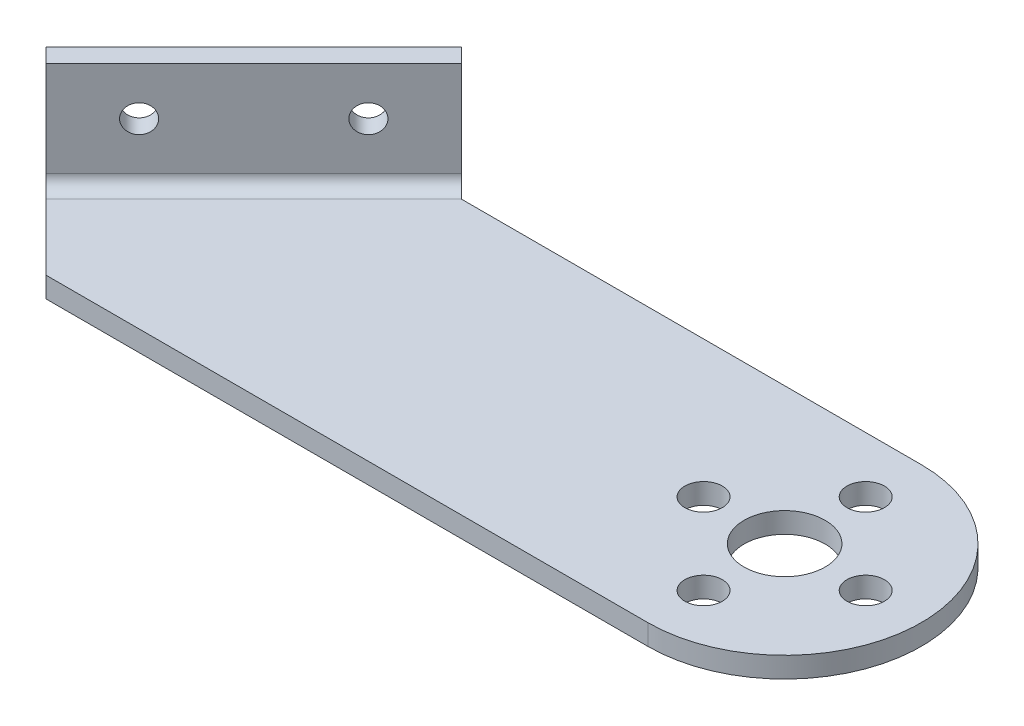
ISO-10303-21;
HEADER;
FILE_DESCRIPTION(('STEP AP214'),'2;1');
FILE_NAME('part.step','',(''),(''),'','','');
FILE_SCHEMA(('AUTOMOTIVE_DESIGN { 1 0 10303 214 1 1 1 1 }'));
ENDSEC;
DATA;
#1=APPLICATION_CONTEXT('core data for automotive mechanical design processes');
#2=APPLICATION_PROTOCOL_DEFINITION('international standard','automotive_design',2000,#1);
#3=PRODUCT_CONTEXT('',#1,'mechanical');
#4=PRODUCT('Part','Part','',(#3));
#5=PRODUCT_RELATED_PRODUCT_CATEGORY('part','',(#4));
#6=PRODUCT_DEFINITION_FORMATION('','',#4);
#7=PRODUCT_DEFINITION_CONTEXT('part definition',#1,'design');
#8=PRODUCT_DEFINITION('design','',#6,#7);
#9=PRODUCT_DEFINITION_SHAPE('','',#8);
#10=(LENGTH_UNIT() NAMED_UNIT(*) SI_UNIT(.MILLI.,.METRE.));
#11=(NAMED_UNIT(*) PLANE_ANGLE_UNIT() SI_UNIT($,.RADIAN.));
#12=(NAMED_UNIT(*) SI_UNIT($,.STERADIAN.) SOLID_ANGLE_UNIT());
#13=UNCERTAINTY_MEASURE_WITH_UNIT(LENGTH_MEASURE(1.E-05),#10,'distance_accuracy_value','');
#14=(GEOMETRIC_REPRESENTATION_CONTEXT(3) GLOBAL_UNCERTAINTY_ASSIGNED_CONTEXT((#13)) GLOBAL_UNIT_ASSIGNED_CONTEXT((#10,
#11,#12)) REPRESENTATION_CONTEXT('',''));
#15=CARTESIAN_POINT('',(0.,0.,0.));
#16=DIRECTION('',(0.,0.,1.));
#17=DIRECTION('',(1.,0.,0.));
#18=AXIS2_PLACEMENT_3D('',#15,#16,#17);
#19=CARTESIAN_POINT('',(13.7940246351911,7.968,-9.12741699796952));
#20=DIRECTION('',(-0.707106781186547,0.,-0.707106781186548));
#21=DIRECTION('',(-0.707106781186547,0.,0.707106781186548));
#22=AXIS2_PLACEMENT_3D('',#19,#20,#21);
#23=CYLINDRICAL_SURFACE('',#22,1.36525);
#24=CARTESIAN_POINT('',(11.6727042916315,7.968,-11.2487373415292));
#25=DIRECTION('',(-0.707106781186547,0.,-0.707106781186548));
#26=DIRECTION('',(-0.707106781186547,0.,0.707106781186548));
#27=AXIS2_PLACEMENT_3D('',#24,#25,#26);
#28=CIRCLE('',#27,1.36525);
#29=CARTESIAN_POINT('',(10.7073267586166,7.968,-10.2833598085142));
#30=VERTEX_POINT('',#29);
#31=EDGE_CURVE('E165',#30,#30,#28,.T.);
#32=ORIENTED_EDGE('',*,*,#31,.T.);
#33=EDGE_LOOP('',(#32));
#34=FACE_BOUND('',#33,.T.);
#35=CARTESIAN_POINT('',(13.1095452710026,7.968,-9.8118963621581));
#36=DIRECTION('',(-0.707106781186547,0.,-0.707106781186548));
#37=DIRECTION('',(-0.707106781186547,0.,0.707106781186548));
#38=AXIS2_PLACEMENT_3D('',#35,#36,#37);
#39=CIRCLE('',#38,1.36525);
#40=CARTESIAN_POINT('',(12.1441677379876,7.968,-8.84651882914316));
#41=VERTEX_POINT('',#40);
#42=EDGE_CURVE('E207',#41,#41,#39,.T.);
#43=ORIENTED_EDGE('',*,*,#42,.F.);
#44=EDGE_LOOP('',(#43));
#45=FACE_BOUND('',#44,.T.);
#46=ADVANCED_FACE('F50',(#34,#45),#23,.F.);
#47=CARTESIAN_POINT('',(2.48031613620639,7.968,2.18629150101524));
#48=DIRECTION('',(-0.707106781186547,0.,-0.707106781186548));
#49=DIRECTION('',(-0.707106781186547,0.,0.707106781186548));
#50=AXIS2_PLACEMENT_3D('',#47,#48,#49);
#51=CYLINDRICAL_SURFACE('',#50,1.36525);
#52=CARTESIAN_POINT('',(0.358995792646742,7.968,0.0649711574555985));
#53=DIRECTION('',(-0.707106781186547,0.,-0.707106781186548));
#54=DIRECTION('',(-0.707106781186547,0.,0.707106781186548));
#55=AXIS2_PLACEMENT_3D('',#52,#53,#54);
#56=CIRCLE('',#55,1.36525);
#57=CARTESIAN_POINT('',(-0.606381740368192,7.968,1.03034869047053));
#58=VERTEX_POINT('',#57);
#59=EDGE_CURVE('E226',#58,#58,#56,.T.);
#60=ORIENTED_EDGE('',*,*,#59,.T.);
#61=EDGE_LOOP('',(#60));
#62=FACE_BOUND('',#61,.T.);
#63=CARTESIAN_POINT('',(1.79583677201781,7.968,1.50181213682667));
#64=DIRECTION('',(-0.707106781186547,0.,-0.707106781186548));
#65=DIRECTION('',(-0.707106781186547,0.,0.707106781186548));
#66=AXIS2_PLACEMENT_3D('',#63,#64,#65);
#67=CIRCLE('',#66,1.36525);
#68=CARTESIAN_POINT('',(0.830459239002876,7.968,2.4671896698416));
#69=VERTEX_POINT('',#68);
#70=EDGE_CURVE('E212',#69,#69,#67,.T.);
#71=ORIENTED_EDGE('',*,*,#70,.F.);
#72=EDGE_LOOP('',(#71));
#73=FACE_BOUND('',#72,.T.);
#74=ADVANCED_FACE('F245',(#62,#73),#51,.F.);
#75=CARTESIAN_POINT('',(70.5718707373461,12.668,38.4580409487604));
#76=DIRECTION('',(0.,1.,0.));
#77=DIRECTION('',(-0.707106781186548,0.,0.707106781186548));
#78=AXIS2_PLACEMENT_3D('',#75,#76,#77);
#79=PLANE('',#78);
#80=DIRECTION('',(-0.707106781186547,0.,-0.707106781186548));
#81=VECTOR('',#80,1.);
#82=CARTESIAN_POINT('',(70.5718707373461,12.668,38.4580409487604));
#83=LINE('',#82,#81);
#84=CARTESIAN_POINT('',(17.7057393487151,12.668,-14.4080904398707));
#85=VERTEX_POINT('',#84);
#86=CARTESIAN_POINT('',(16.2688983693441,12.668,-15.8449314192417));
#87=VERTEX_POINT('',#86);
#88=EDGE_CURVE('E224',#85,#87,#83,.T.);
#89=ORIENTED_EDGE('',*,*,#88,.T.);
#90=DIRECTION('',(-0.707106781186547,0.,0.707106781186548));
#91=VECTOR('',#90,1.);
#92=CARTESIAN_POINT('',(16.2688983693441,12.668,-15.8449314192417));
#93=LINE('',#92,#91);
#94=CARTESIAN_POINT('',(-4.23719828506581,12.668,4.66116523516816));
#95=VERTEX_POINT('',#94);
#96=EDGE_CURVE('E146',#87,#95,#93,.T.);
#97=ORIENTED_EDGE('',*,*,#96,.T.);
#98=DIRECTION('',(-0.707106781186547,0.,-0.707106781186548));
#99=VECTOR('',#98,1.);
#100=CARTESIAN_POINT('',(50.0657740829363,12.668,58.9641376031703));
#101=LINE('',#100,#99);
#102=CARTESIAN_POINT('',(-2.80035730569475,12.668,6.09800621453922));
#103=VERTEX_POINT('',#102);
#104=EDGE_CURVE('E215',#103,#95,#101,.T.);
#105=ORIENTED_EDGE('',*,*,#104,.F.);
#106=DIRECTION('',(0.707106781186547,0.,-0.707106781186548));
#107=VECTOR('',#106,1.);
#108=CARTESIAN_POINT('',(17.7057393487151,12.668,-14.4080904398707));
#109=LINE('',#108,#107);
#110=EDGE_CURVE('E69',#103,#85,#109,.T.);
#111=ORIENTED_EDGE('',*,*,#110,.T.);
#112=EDGE_LOOP('',(#89,#97,#105,#111));
#113=FACE_BOUND('',#112,.T.);
#114=ADVANCED_FACE('F242',(#113),#79,.T.);
#115=CARTESIAN_POINT('',(70.5718707373461,12.668,38.4580409487604));
#116=DIRECTION('',(0.707106781186548,0.,-0.707106781186547));
#117=DIRECTION('',(0.,1.,0.));
#118=AXIS2_PLACEMENT_3D('',#115,#116,#117);
#119=PLANE('',#118);
#120=DIRECTION('',(-0.707106781186547,0.,-0.707106781186548));
#121=VECTOR('',#120,1.);
#122=CARTESIAN_POINT('',(70.5718707373461,3.27,38.4580409487604));
#123=LINE('',#122,#121);
#124=CARTESIAN_POINT('',(17.7057393487151,3.27,-14.4080904398707));
#125=VERTEX_POINT('',#124);
#126=CARTESIAN_POINT('',(16.2688983693441,3.27000000000001,-15.8449314192417));
#127=VERTEX_POINT('',#126);
#128=EDGE_CURVE('E148',#125,#127,#123,.T.);
#129=ORIENTED_EDGE('',*,*,#128,.T.);
#130=DIRECTION('',(0.,1.,0.));
#131=VECTOR('',#130,1.);
#132=CARTESIAN_POINT('',(16.2688983693441,-0.0320000000000003,-15.8449314192417));
#133=LINE('',#132,#131);
#134=EDGE_CURVE('E94',#127,#87,#133,.T.);
#135=ORIENTED_EDGE('',*,*,#134,.T.);
#136=ORIENTED_EDGE('',*,*,#88,.F.);
#137=DIRECTION('',(0.,-1.,0.));
#138=VECTOR('',#137,1.);
#139=CARTESIAN_POINT('',(17.7057393487151,12.668,-14.4080904398707));
#140=LINE('',#139,#138);
#141=EDGE_CURVE('E147',#85,#125,#140,.T.);
#142=ORIENTED_EDGE('',*,*,#141,.T.);
#143=EDGE_LOOP('',(#129,#135,#136,#142));
#144=FACE_BOUND('',#143,.T.);
#145=ADVANCED_FACE('F152',(#144),#119,.T.);
#146=CARTESIAN_POINT('',(16.2688983693441,-0.0320000000000003,-15.8449314192417));
#147=DIRECTION('',(-0.707106781186547,0.,-0.707106781186548));
#148=DIRECTION('',(-0.707106781186548,0.,0.707106781186548));
#149=AXIS2_PLACEMENT_3D('',#146,#147,#148);
#150=PLANE('',#149);
#151=DIRECTION('',(0.707106781186548,0.,-0.707106781186547));
#152=VECTOR('',#151,1.);
#153=CARTESIAN_POINT('',(16.2688983693441,3.27,-15.8449314192417));
#154=LINE('',#153,#152);
#155=CARTESIAN_POINT('',(-4.23719828506581,3.27,4.66116523516816));
#156=VERTEX_POINT('',#155);
#157=EDGE_CURVE('E88',#156,#127,#154,.T.);
#158=ORIENTED_EDGE('',*,*,#157,.F.);
#159=DIRECTION('',(0.,1.,0.));
#160=VECTOR('',#159,1.);
#161=CARTESIAN_POINT('',(-4.23719828506582,12.668,4.66116523516816));
#162=LINE('',#161,#160);
#163=EDGE_CURVE('E217',#156,#95,#162,.T.);
#164=ORIENTED_EDGE('',*,*,#163,.T.);
#165=ORIENTED_EDGE('',*,*,#96,.F.);
#166=ORIENTED_EDGE('',*,*,#134,.F.);
#167=EDGE_LOOP('',(#158,#164,#165,#166));
#168=FACE_BOUND('',#167,.T.);
#169=ORIENTED_EDGE('',*,*,#59,.F.);
#170=EDGE_LOOP('',(#169));
#171=FACE_BOUND('',#170,.T.);
#172=ORIENTED_EDGE('',*,*,#31,.F.);
#173=EDGE_LOOP('',(#172));
#174=FACE_BOUND('',#173,.T.);
#175=ADVANCED_FACE('F143',(#168,#171,#174),#150,.T.);
#176=CARTESIAN_POINT('',(50.0657740829363,12.668,58.9641376031703));
#177=DIRECTION('',(0.707106781186548,0.,-0.707106781186547));
#178=DIRECTION('',(0.,1.,0.));
#179=AXIS2_PLACEMENT_3D('',#176,#177,#178);
#180=PLANE('',#179);
#181=ORIENTED_EDGE('',*,*,#163,.F.);
#182=DIRECTION('',(-0.707106781186547,0.,-0.707106781186548));
#183=VECTOR('',#182,1.);
#184=CARTESIAN_POINT('',(50.0657740829363,3.27,58.9641376031703));
#185=LINE('',#184,#183);
#186=CARTESIAN_POINT('',(-2.80035730569475,3.27,6.09800621453922));
#187=VERTEX_POINT('',#186);
#188=EDGE_CURVE('E54',#187,#156,#185,.T.);
#189=ORIENTED_EDGE('',*,*,#188,.F.);
#190=DIRECTION('',(0.,-1.,0.));
#191=VECTOR('',#190,1.);
#192=CARTESIAN_POINT('',(-2.80035730569475,12.668,6.09800621453922));
#193=LINE('',#192,#191);
#194=EDGE_CURVE('E60',#103,#187,#193,.T.);
#195=ORIENTED_EDGE('',*,*,#194,.F.);
#196=ORIENTED_EDGE('',*,*,#104,.T.);
#197=EDGE_LOOP('',(#181,#189,#195,#196));
#198=FACE_BOUND('',#197,.T.);
#199=ADVANCED_FACE('F235',(#198),#180,.F.);
#200=CARTESIAN_POINT('',(17.7057393487151,12.668,-14.4080904398707));
#201=DIRECTION('',(-0.707106781186547,0.,-0.707106781186548));
#202=DIRECTION('',(-0.707106781186547,0.,0.707106781186548));
#203=AXIS2_PLACEMENT_3D('',#200,#201,#202);
#204=PLANE('',#203);
#205=ORIENTED_EDGE('',*,*,#70,.T.);
#206=EDGE_LOOP('',(#205));
#207=FACE_BOUND('',#206,.T.);
#208=ORIENTED_EDGE('',*,*,#42,.T.);
#209=EDGE_LOOP('',(#208));
#210=FACE_BOUND('',#209,.T.);
#211=ORIENTED_EDGE('',*,*,#194,.T.);
#212=DIRECTION('',(0.707106781186548,0.,-0.707106781186547));
#213=VECTOR('',#212,1.);
#214=CARTESIAN_POINT('',(17.7057393487151,3.27,-14.4080904398706));
#215=LINE('',#214,#213);
#216=EDGE_CURVE('E13',#187,#125,#215,.T.);
#217=ORIENTED_EDGE('',*,*,#216,.T.);
#218=ORIENTED_EDGE('',*,*,#141,.F.);
#219=ORIENTED_EDGE('',*,*,#110,.F.);
#220=EDGE_LOOP('',(#211,#217,#218,#219));
#221=FACE_BOUND('',#220,.T.);
#222=ADVANCED_FACE('F52',(#207,#210,#221),#204,.F.);
#223=CARTESIAN_POINT('',(64.,-0.0319999999999999,0.));
#224=DIRECTION('',(0.,1.,0.));
#225=DIRECTION('',(0.,0.,1.));
#226=AXIS2_PLACEMENT_3D('',#223,#224,#225);
#227=PLANE('',#226);
#228=CARTESIAN_POINT('',(56.,-0.0319999999999999,0.));
#229=DIRECTION('',(0.,1.,0.));
#230=DIRECTION('',(0.,0.,-1.));
#231=AXIS2_PLACEMENT_3D('',#228,#229,#230);
#232=CIRCLE('',#231,1.85);
#233=CARTESIAN_POINT('',(56.,-0.0319999999999999,-1.85));
#234=VERTEX_POINT('',#233);
#235=EDGE_CURVE('E290',#234,#234,#232,.T.);
#236=ORIENTED_EDGE('',*,*,#235,.T.);
#237=EDGE_LOOP('',(#236));
#238=FACE_BOUND('',#237,.T.);
#239=CARTESIAN_POINT('',(64.,-0.0319999999999999,8.));
#240=DIRECTION('',(0.,1.,0.));
#241=DIRECTION('',(0.,0.,-1.));
#242=AXIS2_PLACEMENT_3D('',#239,#240,#241);
#243=CIRCLE('',#242,1.85);
#244=CARTESIAN_POINT('',(64.,-0.0319999999999999,6.15));
#245=VERTEX_POINT('',#244);
#246=EDGE_CURVE('E371',#245,#245,#243,.T.);
#247=ORIENTED_EDGE('',*,*,#246,.T.);
#248=EDGE_LOOP('',(#247));
#249=FACE_BOUND('',#248,.T.);
#250=CARTESIAN_POINT('',(72.,-0.0319999999999999,0.));
#251=DIRECTION('',(0.,1.,0.));
#252=DIRECTION('',(0.,0.,-1.));
#253=AXIS2_PLACEMENT_3D('',#250,#251,#252);
#254=CIRCLE('',#253,1.85);
#255=CARTESIAN_POINT('',(72.,-0.0319999999999999,-1.85));
#256=VERTEX_POINT('',#255);
#257=EDGE_CURVE('E368',#256,#256,#254,.T.);
#258=ORIENTED_EDGE('',*,*,#257,.T.);
#259=EDGE_LOOP('',(#258));
#260=FACE_BOUND('',#259,.T.);
#261=CARTESIAN_POINT('',(64.,-0.0319999999999999,-8.));
#262=DIRECTION('',(0.,1.,0.));
#263=DIRECTION('',(0.,0.,-1.));
#264=AXIS2_PLACEMENT_3D('',#261,#262,#263);
#265=CIRCLE('',#264,1.85);
#266=CARTESIAN_POINT('',(64.,-0.0319999999999999,-9.85));
#267=VERTEX_POINT('',#266);
#268=EDGE_CURVE('E359',#267,#267,#265,.T.);
#269=ORIENTED_EDGE('',*,*,#268,.T.);
#270=EDGE_LOOP('',(#269));
#271=FACE_BOUND('',#270,.T.);
#272=CARTESIAN_POINT('',(64.,-0.0319999999999999,0.));
#273=DIRECTION('',(0.,1.,0.));
#274=DIRECTION('',(0.,0.,-1.));
#275=AXIS2_PLACEMENT_3D('',#272,#273,#274);
#276=CIRCLE('',#275,4.);
#277=CARTESIAN_POINT('',(64.,-0.0319999999999999,-4.));
#278=VERTEX_POINT('',#277);
#279=EDGE_CURVE('E355',#278,#278,#276,.T.);
#280=ORIENTED_EDGE('',*,*,#279,.T.);
#281=EDGE_LOOP('',(#280));
#282=FACE_BOUND('',#281,.T.);
#283=DIRECTION('',(-0.707106781186547,0.,0.707106781186548));
#284=VECTOR('',#283,1.);
#285=CARTESIAN_POINT('',(18.603764960822,-0.0320000000000042,-13.5100648277637));
#286=LINE('',#285,#284);
#287=CARTESIAN_POINT('',(18.603764960822,-0.0319999999999999,-13.5100648277637));
#288=VERTEX_POINT('',#287);
#289=CARTESIAN_POINT('',(-1.90233169358786,-0.031999999999999,6.99603182664613));
#290=VERTEX_POINT('',#289);
#291=EDGE_CURVE('E190',#288,#290,#286,.T.);
#292=ORIENTED_EDGE('',*,*,#291,.F.);
#293=DIRECTION('',(-0.707106781186547,0.,-0.707106781186548));
#294=VECTOR('',#293,1.);
#295=CARTESIAN_POINT('',(18.6138297885858,-0.0319999999999999,-13.5));
#296=LINE('',#295,#294);
#297=CARTESIAN_POINT('',(18.6138297885858,-0.0320000000000042,-13.5));
#298=VERTEX_POINT('',#297);
#299=EDGE_CURVE('E282',#298,#288,#296,.T.);
#300=ORIENTED_EDGE('',*,*,#299,.F.);
#301=DIRECTION('',(-1.,0.,0.));
#302=VECTOR('',#301,1.);
#303=CARTESIAN_POINT('',(64.,-0.0319999999999999,-13.5));
#304=LINE('',#303,#302);
#305=CARTESIAN_POINT('',(64.,-0.0319999999999999,-13.5));
#306=VERTEX_POINT('',#305);
#307=EDGE_CURVE('E285',#306,#298,#304,.T.);
#308=ORIENTED_EDGE('',*,*,#307,.F.);
#309=CARTESIAN_POINT('',(64.,-0.0319999999999999,0.));
#310=DIRECTION('',(0.,1.,0.));
#311=DIRECTION('',(0.,0.,1.));
#312=AXIS2_PLACEMENT_3D('',#309,#310,#311);
#313=CIRCLE('',#312,13.5);
#314=CARTESIAN_POINT('',(64.,-0.0319999999999999,13.5));
#315=VERTEX_POINT('',#314);
#316=EDGE_CURVE('E288',#315,#306,#313,.T.);
#317=ORIENTED_EDGE('',*,*,#316,.F.);
#318=DIRECTION('',(1.,0.,0.));
#319=VECTOR('',#318,1.);
#320=CARTESIAN_POINT('',(4.60163647976604,-0.0319999999999999,13.5));
#321=LINE('',#320,#319);
#322=CARTESIAN_POINT('',(4.60163647976604,-0.0319999999999999,13.5));
#323=VERTEX_POINT('',#322);
#324=EDGE_CURVE('E185',#323,#315,#321,.T.);
#325=ORIENTED_EDGE('',*,*,#324,.F.);
#326=DIRECTION('',(0.707106781186548,0.,0.707106781186547));
#327=VECTOR('',#326,1.);
#328=CARTESIAN_POINT('',(-4.23719828506582,-0.0319999999999999,4.66116523516815));
#329=LINE('',#328,#327);
#330=EDGE_CURVE('E286',#290,#323,#329,.T.);
#331=ORIENTED_EDGE('',*,*,#330,.F.);
#332=EDGE_LOOP('',(#292,#300,#308,#317,#325,#331));
#333=FACE_BOUND('',#332,.T.);
#334=ADVANCED_FACE('F331',(#238,#249,#260,#271,#282,#333),#227,.F.);
#335=CARTESIAN_POINT('',(64.,2.,0.));
#336=DIRECTION('',(0.,1.,0.));
#337=DIRECTION('',(0.,0.,1.));
#338=AXIS2_PLACEMENT_3D('',#335,#336,#337);
#339=PLANE('',#338);
#340=CARTESIAN_POINT('',(64.,2.,0.));
#341=DIRECTION('',(0.,1.,0.));
#342=DIRECTION('',(0.,0.,-1.));
#343=AXIS2_PLACEMENT_3D('',#340,#341,#342);
#344=CIRCLE('',#343,4.);
#345=CARTESIAN_POINT('',(64.,2.,-4.));
#346=VERTEX_POINT('',#345);
#347=EDGE_CURVE('E385',#346,#346,#344,.T.);
#348=ORIENTED_EDGE('',*,*,#347,.F.);
#349=EDGE_LOOP('',(#348));
#350=FACE_BOUND('',#349,.T.);
#351=CARTESIAN_POINT('',(64.,2.,-8.));
#352=DIRECTION('',(0.,1.,0.));
#353=DIRECTION('',(0.,0.,-1.));
#354=AXIS2_PLACEMENT_3D('',#351,#352,#353);
#355=CIRCLE('',#354,1.85);
#356=CARTESIAN_POINT('',(64.,2.,-9.85));
#357=VERTEX_POINT('',#356);
#358=EDGE_CURVE('E383',#357,#357,#355,.T.);
#359=ORIENTED_EDGE('',*,*,#358,.F.);
#360=EDGE_LOOP('',(#359));
#361=FACE_BOUND('',#360,.T.);
#362=CARTESIAN_POINT('',(72.,2.,0.));
#363=DIRECTION('',(0.,1.,0.));
#364=DIRECTION('',(0.,0.,-1.));
#365=AXIS2_PLACEMENT_3D('',#362,#363,#364);
#366=CIRCLE('',#365,1.85);
#367=CARTESIAN_POINT('',(72.,2.,-1.85));
#368=VERTEX_POINT('',#367);
#369=EDGE_CURVE('E362',#368,#368,#366,.T.);
#370=ORIENTED_EDGE('',*,*,#369,.F.);
#371=EDGE_LOOP('',(#370));
#372=FACE_BOUND('',#371,.T.);
#373=CARTESIAN_POINT('',(64.,2.,8.));
#374=DIRECTION('',(0.,1.,0.));
#375=DIRECTION('',(0.,0.,-1.));
#376=AXIS2_PLACEMENT_3D('',#373,#374,#375);
#377=CIRCLE('',#376,1.85);
#378=CARTESIAN_POINT('',(64.,2.,6.15));
#379=VERTEX_POINT('',#378);
#380=EDGE_CURVE('E356',#379,#379,#377,.T.);
#381=ORIENTED_EDGE('',*,*,#380,.F.);
#382=EDGE_LOOP('',(#381));
#383=FACE_BOUND('',#382,.T.);
#384=CARTESIAN_POINT('',(56.,2.,0.));
#385=DIRECTION('',(0.,1.,0.));
#386=DIRECTION('',(0.,0.,-1.));
#387=AXIS2_PLACEMENT_3D('',#384,#385,#386);
#388=CIRCLE('',#387,1.85);
#389=CARTESIAN_POINT('',(56.,2.,-1.85));
#390=VERTEX_POINT('',#389);
#391=EDGE_CURVE('E353',#390,#390,#388,.T.);
#392=ORIENTED_EDGE('',*,*,#391,.F.);
#393=EDGE_LOOP('',(#392));
#394=FACE_BOUND('',#393,.T.);
#395=DIRECTION('',(-0.707106781186547,0.,-0.707106781186548));
#396=VECTOR('',#395,1.);
#397=CARTESIAN_POINT('',(18.6138297885858,2.,-13.5));
#398=LINE('',#397,#396);
#399=CARTESIAN_POINT('',(18.6138297885858,2.,-13.5));
#400=VERTEX_POINT('',#399);
#401=CARTESIAN_POINT('',(18.603764960822,2.,-13.5100648277637));
#402=VERTEX_POINT('',#401);
#403=EDGE_CURVE('E279',#400,#402,#398,.T.);
#404=ORIENTED_EDGE('',*,*,#403,.T.);
#405=DIRECTION('',(-0.707106781186547,0.,0.707106781186548));
#406=VECTOR('',#405,1.);
#407=CARTESIAN_POINT('',(18.603764960822,2.,-13.5100648277637));
#408=LINE('',#407,#406);
#409=CARTESIAN_POINT('',(-1.90233169358783,2.,6.99603182664614));
#410=VERTEX_POINT('',#409);
#411=EDGE_CURVE('E187',#402,#410,#408,.T.);
#412=ORIENTED_EDGE('',*,*,#411,.T.);
#413=DIRECTION('',(0.707106781186548,0.,0.707106781186547));
#414=VECTOR('',#413,1.);
#415=CARTESIAN_POINT('',(-4.23719828506582,2.,4.66116523516815));
#416=LINE('',#415,#414);
#417=CARTESIAN_POINT('',(4.60163647976604,2.,13.5));
#418=VERTEX_POINT('',#417);
#419=EDGE_CURVE('E171',#410,#418,#416,.T.);
#420=ORIENTED_EDGE('',*,*,#419,.T.);
#421=DIRECTION('',(1.,0.,0.));
#422=VECTOR('',#421,1.);
#423=CARTESIAN_POINT('',(4.60163647976604,2.,13.5));
#424=LINE('',#423,#422);
#425=CARTESIAN_POINT('',(64.,2.,13.5));
#426=VERTEX_POINT('',#425);
#427=EDGE_CURVE('E102',#418,#426,#424,.T.);
#428=ORIENTED_EDGE('',*,*,#427,.T.);
#429=CARTESIAN_POINT('',(64.,2.,0.));
#430=DIRECTION('',(0.,1.,0.));
#431=DIRECTION('',(0.,0.,1.));
#432=AXIS2_PLACEMENT_3D('',#429,#430,#431);
#433=CIRCLE('',#432,13.5);
#434=CARTESIAN_POINT('',(64.,2.,-13.5));
#435=VERTEX_POINT('',#434);
#436=EDGE_CURVE('E110',#426,#435,#433,.T.);
#437=ORIENTED_EDGE('',*,*,#436,.T.);
#438=DIRECTION('',(-1.,0.,0.));
#439=VECTOR('',#438,1.);
#440=CARTESIAN_POINT('',(64.,2.,-13.5));
#441=LINE('',#440,#439);
#442=EDGE_CURVE('E394',#435,#400,#441,.T.);
#443=ORIENTED_EDGE('',*,*,#442,.T.);
#444=EDGE_LOOP('',(#404,#412,#420,#428,#437,#443));
#445=FACE_BOUND('',#444,.T.);
#446=ADVANCED_FACE('F276',(#350,#361,#372,#383,#394,#445),#339,.T.);
#447=CARTESIAN_POINT('',(56.,-0.0319999999999999,0.));
#448=DIRECTION('',(0.,1.,0.));
#449=DIRECTION('',(0.,0.,1.));
#450=AXIS2_PLACEMENT_3D('',#447,#448,#449);
#451=CYLINDRICAL_SURFACE('',#450,1.85);
#452=ORIENTED_EDGE('',*,*,#235,.F.);
#453=EDGE_LOOP('',(#452));
#454=FACE_BOUND('',#453,.T.);
#455=ORIENTED_EDGE('',*,*,#391,.T.);
#456=EDGE_LOOP('',(#455));
#457=FACE_BOUND('',#456,.T.);
#458=ADVANCED_FACE('F340',(#454,#457),#451,.F.);
#459=CARTESIAN_POINT('',(64.,-0.0319999999999999,8.));
#460=DIRECTION('',(0.,1.,0.));
#461=DIRECTION('',(0.,0.,1.));
#462=AXIS2_PLACEMENT_3D('',#459,#460,#461);
#463=CYLINDRICAL_SURFACE('',#462,1.85);
#464=ORIENTED_EDGE('',*,*,#246,.F.);
#465=EDGE_LOOP('',(#464));
#466=FACE_BOUND('',#465,.T.);
#467=ORIENTED_EDGE('',*,*,#380,.T.);
#468=EDGE_LOOP('',(#467));
#469=FACE_BOUND('',#468,.T.);
#470=ADVANCED_FACE('F337',(#466,#469),#463,.F.);
#471=CARTESIAN_POINT('',(72.,-0.0319999999999999,0.));
#472=DIRECTION('',(0.,1.,0.));
#473=DIRECTION('',(0.,0.,1.));
#474=AXIS2_PLACEMENT_3D('',#471,#472,#473);
#475=CYLINDRICAL_SURFACE('',#474,1.85);
#476=ORIENTED_EDGE('',*,*,#257,.F.);
#477=EDGE_LOOP('',(#476));
#478=FACE_BOUND('',#477,.T.);
#479=ORIENTED_EDGE('',*,*,#369,.T.);
#480=EDGE_LOOP('',(#479));
#481=FACE_BOUND('',#480,.T.);
#482=ADVANCED_FACE('F323',(#478,#481),#475,.F.);
#483=CARTESIAN_POINT('',(64.,-0.0319999999999999,-8.));
#484=DIRECTION('',(0.,1.,0.));
#485=DIRECTION('',(0.,0.,1.));
#486=AXIS2_PLACEMENT_3D('',#483,#484,#485);
#487=CYLINDRICAL_SURFACE('',#486,1.85);
#488=ORIENTED_EDGE('',*,*,#268,.F.);
#489=EDGE_LOOP('',(#488));
#490=FACE_BOUND('',#489,.T.);
#491=ORIENTED_EDGE('',*,*,#358,.T.);
#492=EDGE_LOOP('',(#491));
#493=FACE_BOUND('',#492,.T.);
#494=ADVANCED_FACE('F317',(#490,#493),#487,.F.);
#495=CARTESIAN_POINT('',(64.,-0.0319999999999999,0.));
#496=DIRECTION('',(0.,1.,0.));
#497=DIRECTION('',(0.,0.,1.));
#498=AXIS2_PLACEMENT_3D('',#495,#496,#497);
#499=CYLINDRICAL_SURFACE('',#498,4.);
#500=ORIENTED_EDGE('',*,*,#279,.F.);
#501=EDGE_LOOP('',(#500));
#502=FACE_BOUND('',#501,.T.);
#503=ORIENTED_EDGE('',*,*,#347,.T.);
#504=EDGE_LOOP('',(#503));
#505=FACE_BOUND('',#504,.T.);
#506=ADVANCED_FACE('F313',(#502,#505),#499,.F.);
#507=CARTESIAN_POINT('',(18.6138297885858,167.70915631387,-13.5));
#508=DIRECTION('',(-0.707106781186548,0.,0.707106781186547));
#509=DIRECTION('',(0.707106781186547,0.,0.707106781186548));
#510=AXIS2_PLACEMENT_3D('',#507,#508,#509);
#511=PLANE('',#510);
#512=DIRECTION('',(0.,-1.,0.));
#513=VECTOR('',#512,1.);
#514=CARTESIAN_POINT('',(18.6138297885858,167.70915631387,-13.5));
#515=LINE('',#514,#513);
#516=EDGE_CURVE('E192',#400,#298,#515,.T.);
#517=ORIENTED_EDGE('',*,*,#516,.T.);
#518=ORIENTED_EDGE('',*,*,#299,.T.);
#519=DIRECTION('',(0.,-1.,0.));
#520=VECTOR('',#519,1.);
#521=CARTESIAN_POINT('',(18.603764960822,167.70915631387,-13.5100648277637));
#522=LINE('',#521,#520);
#523=EDGE_CURVE('E168',#402,#288,#522,.T.);
#524=ORIENTED_EDGE('',*,*,#523,.F.);
#525=ORIENTED_EDGE('',*,*,#403,.F.);
#526=EDGE_LOOP('',(#517,#518,#524,#525));
#527=FACE_BOUND('',#526,.T.);
#528=ADVANCED_FACE('F253',(#527),#511,.F.);
#529=CARTESIAN_POINT('',(-4.23719828506582,167.70915631387,4.66116523516815));
#530=DIRECTION('',(0.707106781186547,0.,-0.707106781186548));
#531=DIRECTION('',(-0.707106781186548,0.,-0.707106781186547));
#532=AXIS2_PLACEMENT_3D('',#529,#530,#531);
#533=PLANE('',#532);
#534=DIRECTION('',(0.,-1.,0.));
#535=VECTOR('',#534,1.);
#536=CARTESIAN_POINT('',(-1.90233169358783,167.70915631387,6.99603182664614));
#537=LINE('',#536,#535);
#538=EDGE_CURVE('E202',#410,#290,#537,.T.);
#539=ORIENTED_EDGE('',*,*,#538,.T.);
#540=ORIENTED_EDGE('',*,*,#330,.T.);
#541=DIRECTION('',(0.,-1.,0.));
#542=VECTOR('',#541,1.);
#543=CARTESIAN_POINT('',(4.60163647976604,167.70915631387,13.5));
#544=LINE('',#543,#542);
#545=EDGE_CURVE('E200',#418,#323,#544,.T.);
#546=ORIENTED_EDGE('',*,*,#545,.F.);
#547=ORIENTED_EDGE('',*,*,#419,.F.);
#548=EDGE_LOOP('',(#539,#540,#546,#547));
#549=FACE_BOUND('',#548,.T.);
#550=ADVANCED_FACE('F273',(#549),#533,.F.);
#551=CARTESIAN_POINT('',(4.60163647976604,167.70915631387,13.5));
#552=DIRECTION('',(0.,0.,-1.));
#553=DIRECTION('',(-1.,0.,0.));
#554=AXIS2_PLACEMENT_3D('',#551,#552,#553);
#555=PLANE('',#554);
#556=ORIENTED_EDGE('',*,*,#545,.T.);
#557=ORIENTED_EDGE('',*,*,#324,.T.);
#558=DIRECTION('',(0.,-1.,0.));
#559=VECTOR('',#558,1.);
#560=CARTESIAN_POINT('',(64.,167.70915631387,13.5));
#561=LINE('',#560,#559);
#562=EDGE_CURVE('E198',#426,#315,#561,.T.);
#563=ORIENTED_EDGE('',*,*,#562,.F.);
#564=ORIENTED_EDGE('',*,*,#427,.F.);
#565=EDGE_LOOP('',(#556,#557,#563,#564));
#566=FACE_BOUND('',#565,.T.);
#567=ADVANCED_FACE('F295',(#566),#555,.F.);
#568=CARTESIAN_POINT('',(64.,167.70915631387,0.));
#569=DIRECTION('',(0.,-1.,0.));
#570=DIRECTION('',(0.,0.,-1.));
#571=AXIS2_PLACEMENT_3D('',#568,#569,#570);
#572=CYLINDRICAL_SURFACE('',#571,13.5);
#573=ORIENTED_EDGE('',*,*,#562,.T.);
#574=ORIENTED_EDGE('',*,*,#316,.T.);
#575=DIRECTION('',(0.,-1.,0.));
#576=VECTOR('',#575,1.);
#577=CARTESIAN_POINT('',(64.,167.70915631387,-13.5));
#578=LINE('',#577,#576);
#579=EDGE_CURVE('E195',#435,#306,#578,.T.);
#580=ORIENTED_EDGE('',*,*,#579,.F.);
#581=ORIENTED_EDGE('',*,*,#436,.F.);
#582=EDGE_LOOP('',(#573,#574,#580,#581));
#583=FACE_BOUND('',#582,.T.);
#584=ADVANCED_FACE('F297',(#583),#572,.T.);
#585=CARTESIAN_POINT('',(64.,167.70915631387,-13.5));
#586=DIRECTION('',(0.,0.,1.));
#587=DIRECTION('',(1.,0.,0.));
#588=AXIS2_PLACEMENT_3D('',#585,#586,#587);
#589=PLANE('',#588);
#590=ORIENTED_EDGE('',*,*,#579,.T.);
#591=ORIENTED_EDGE('',*,*,#307,.T.);
#592=ORIENTED_EDGE('',*,*,#516,.F.);
#593=ORIENTED_EDGE('',*,*,#442,.F.);
#594=EDGE_LOOP('',(#590,#591,#592,#593));
#595=FACE_BOUND('',#594,.T.);
#596=ADVANCED_FACE('F299',(#595),#589,.F.);
#597=CARTESIAN_POINT('',(-1.90233169358783,3.27,6.99603182664615));
#598=DIRECTION('',(-0.707106781186547,0.,0.707106781186548));
#599=DIRECTION('',(0.707106781186548,0.,0.707106781186547));
#600=AXIS2_PLACEMENT_3D('',#597,#598,#599);
#601=PLANE('',#600);
#602=ORIENTED_EDGE('',*,*,#538,.F.);
#603=CARTESIAN_POINT('',(-1.90233169358783,3.27,6.99603182664615));
#604=DIRECTION('',(-0.707106781186547,0.,0.707106781186548));
#605=DIRECTION('',(0.707106781186548,0.,0.707106781186547));
#606=AXIS2_PLACEMENT_3D('',#603,#604,#605);
#607=CIRCLE('',#606,1.27);
#608=EDGE_CURVE('E169',#410,#187,#607,.F.);
#609=ORIENTED_EDGE('',*,*,#608,.T.);
#610=ORIENTED_EDGE('',*,*,#188,.T.);
#611=CARTESIAN_POINT('',(-1.90233169358783,3.27,6.99603182664615));
#612=DIRECTION('',(-0.707106781186547,0.,0.707106781186548));
#613=DIRECTION('',(0.707106781186548,0.,0.707106781186547));
#614=AXIS2_PLACEMENT_3D('',#611,#612,#613);
#615=CIRCLE('',#614,3.302);
#616=EDGE_CURVE('E164',#290,#156,#615,.F.);
#617=ORIENTED_EDGE('',*,*,#616,.F.);
#618=EDGE_LOOP('',(#602,#609,#610,#617));
#619=FACE_BOUND('',#618,.T.);
#620=ADVANCED_FACE('F269',(#619),#601,.T.);
#621=CARTESIAN_POINT('',(18.603764960822,3.27,-13.5100648277637));
#622=DIRECTION('',(0.707106781186547,0.,-0.707106781186548));
#623=DIRECTION('',(-0.707106781186548,0.,-0.707106781186547));
#624=AXIS2_PLACEMENT_3D('',#621,#622,#623);
#625=PLANE('',#624);
#626=ORIENTED_EDGE('',*,*,#128,.F.);
#627=CARTESIAN_POINT('',(18.603764960822,3.27,-13.5100648277637));
#628=DIRECTION('',(-0.707106781186547,0.,0.707106781186548));
#629=DIRECTION('',(0.707106781186548,0.,0.707106781186547));
#630=AXIS2_PLACEMENT_3D('',#627,#628,#629);
#631=CIRCLE('',#630,1.27);
#632=EDGE_CURVE('E174',#125,#402,#631,.T.);
#633=ORIENTED_EDGE('',*,*,#632,.T.);
#634=ORIENTED_EDGE('',*,*,#523,.T.);
#635=CARTESIAN_POINT('',(18.603764960822,3.27,-13.5100648277637));
#636=DIRECTION('',(-0.707106781186547,0.,0.707106781186548));
#637=DIRECTION('',(0.707106781186548,0.,0.707106781186547));
#638=AXIS2_PLACEMENT_3D('',#635,#636,#637);
#639=CIRCLE('',#638,3.302);
#640=EDGE_CURVE('E162',#127,#288,#639,.T.);
#641=ORIENTED_EDGE('',*,*,#640,.F.);
#642=EDGE_LOOP('',(#626,#633,#634,#641));
#643=FACE_BOUND('',#642,.T.);
#644=ADVANCED_FACE('F166',(#643),#625,.T.);
#645=CARTESIAN_POINT('',(86.0781212964586,3.27,-80.9844211634003));
#646=DIRECTION('',(-0.707106781186547,0.,0.707106781186548));
#647=DIRECTION('',(0.707106781186548,0.,0.707106781186547));
#648=AXIS2_PLACEMENT_3D('',#645,#646,#647);
#649=CYLINDRICAL_SURFACE('',#648,3.302);
#650=ORIENTED_EDGE('',*,*,#640,.T.);
#651=ORIENTED_EDGE('',*,*,#291,.T.);
#652=ORIENTED_EDGE('',*,*,#616,.T.);
#653=ORIENTED_EDGE('',*,*,#157,.T.);
#654=EDGE_LOOP('',(#650,#651,#652,#653));
#655=FACE_BOUND('',#654,.T.);
#656=ADVANCED_FACE('F160',(#655),#649,.T.);
#657=CARTESIAN_POINT('',(86.0781212964586,3.27,-80.9844211634003));
#658=DIRECTION('',(-0.707106781186547,0.,0.707106781186548));
#659=DIRECTION('',(0.707106781186548,0.,0.707106781186547));
#660=AXIS2_PLACEMENT_3D('',#657,#658,#659);
#661=CYLINDRICAL_SURFACE('',#660,1.27);
#662=ORIENTED_EDGE('',*,*,#632,.F.);
#663=ORIENTED_EDGE('',*,*,#216,.F.);
#664=ORIENTED_EDGE('',*,*,#608,.F.);
#665=ORIENTED_EDGE('',*,*,#411,.F.);
#666=EDGE_LOOP('',(#662,#663,#664,#665));
#667=FACE_BOUND('',#666,.T.);
#668=ADVANCED_FACE('F265',(#667),#661,.F.);
#669=CLOSED_SHELL('',(#46,#74,#114,#145,#175,#199,#222,#334,#446,#458,#470,#482,#494,#506,#528,
#550,#567,#584,#596,#620,#644,#656,#668));
#670=MANIFOLD_SOLID_BREP('B2',#669);
#671=ADVANCED_BREP_SHAPE_REPRESENTATION('',(#18,#670),#14);
#672=SHAPE_DEFINITION_REPRESENTATION(#9,#671);
ENDSEC;
END-ISO-10303-21;
